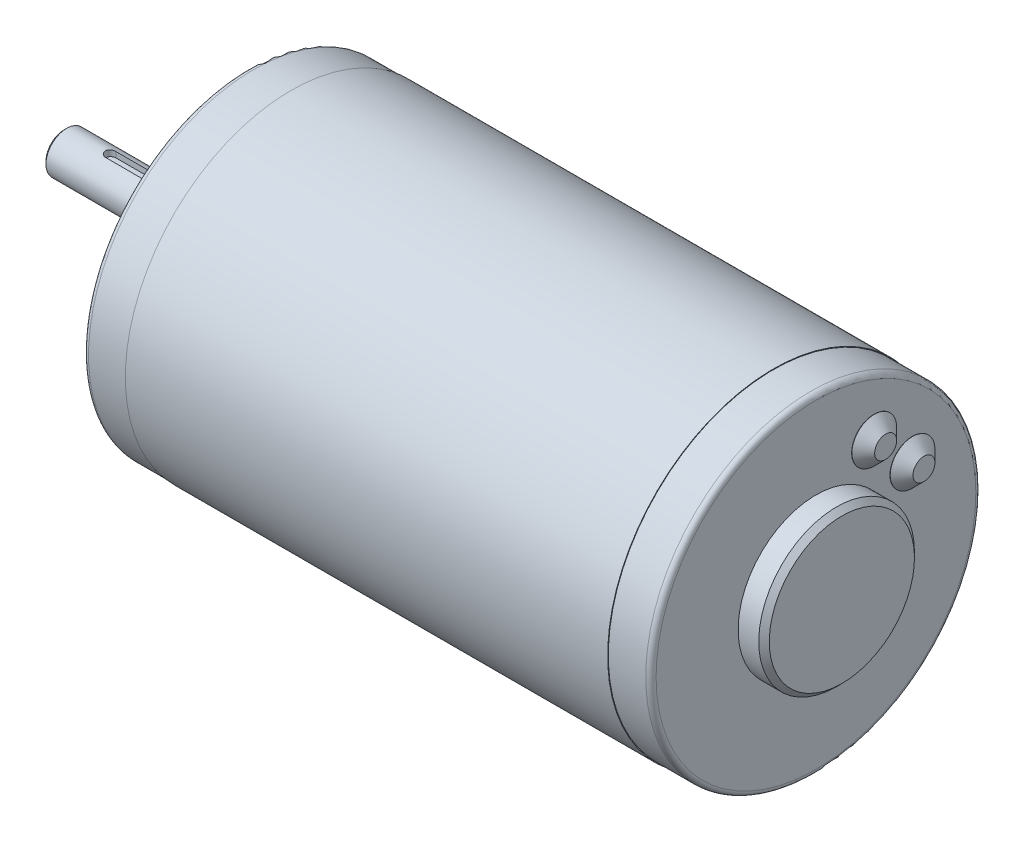
ISO-10303-21;
HEADER;
FILE_DESCRIPTION(('STEP AP214'),'2;1');
FILE_NAME('part.step','',(''),(''),'','','');
FILE_SCHEMA(('AUTOMOTIVE_DESIGN { 1 0 10303 214 1 1 1 1 }'));
ENDSEC;
DATA;
#1=APPLICATION_CONTEXT('core data for automotive mechanical design processes');
#2=APPLICATION_PROTOCOL_DEFINITION('international standard','automotive_design',2000,#1);
#3=PRODUCT_CONTEXT('',#1,'mechanical');
#4=PRODUCT('Part','Part','',(#3));
#5=PRODUCT_RELATED_PRODUCT_CATEGORY('part','',(#4));
#6=PRODUCT_DEFINITION_FORMATION('','',#4);
#7=PRODUCT_DEFINITION_CONTEXT('part definition',#1,'design');
#8=PRODUCT_DEFINITION('design','',#6,#7);
#9=PRODUCT_DEFINITION_SHAPE('','',#8);
#10=(LENGTH_UNIT() NAMED_UNIT(*) SI_UNIT(.MILLI.,.METRE.));
#11=(NAMED_UNIT(*) PLANE_ANGLE_UNIT() SI_UNIT($,.RADIAN.));
#12=(NAMED_UNIT(*) SI_UNIT($,.STERADIAN.) SOLID_ANGLE_UNIT());
#13=UNCERTAINTY_MEASURE_WITH_UNIT(LENGTH_MEASURE(1.E-05),#10,'distance_accuracy_value','');
#14=(GEOMETRIC_REPRESENTATION_CONTEXT(3) GLOBAL_UNCERTAINTY_ASSIGNED_CONTEXT((#13)) GLOBAL_UNIT_ASSIGNED_CONTEXT((#10,
#11,#12)) REPRESENTATION_CONTEXT('',''));
#15=CARTESIAN_POINT('',(0.,0.,0.));
#16=DIRECTION('',(0.,0.,1.));
#17=DIRECTION('',(1.,0.,0.));
#18=AXIS2_PLACEMENT_3D('',#15,#16,#17);
#19=CARTESIAN_POINT('',(-27.6,2.79999999999999,-1.));
#20=DIRECTION('',(0.,-1.,0.));
#21=DIRECTION('',(0.,0.,-1.));
#22=AXIS2_PLACEMENT_3D('',#19,#20,#21);
#23=PLANE('',#22);
#24=CARTESIAN_POINT('',(-7.1,2.79999999999999,0.));
#25=DIRECTION('',(0.,1.,0.));
#26=DIRECTION('',(0.,0.,1.));
#27=AXIS2_PLACEMENT_3D('',#24,#25,#26);
#28=CIRCLE('',#27,1.);
#29=CARTESIAN_POINT('',(-7.1,2.79999999999999,1.));
#30=VERTEX_POINT('',#29);
#31=CARTESIAN_POINT('',(-7.1,2.79999999999999,-1.));
#32=VERTEX_POINT('',#31);
#33=EDGE_CURVE('E80',#30,#32,#28,.T.);
#34=ORIENTED_EDGE('',*,*,#33,.T.);
#35=DIRECTION('',(1.,0.,0.));
#36=VECTOR('',#35,1.);
#37=CARTESIAN_POINT('',(-27.6,2.79999999999999,-1.));
#38=LINE('',#37,#36);
#39=CARTESIAN_POINT('',(-26.6,2.79999999999999,-1.));
#40=VERTEX_POINT('',#39);
#41=EDGE_CURVE('E75',#40,#32,#38,.T.);
#42=ORIENTED_EDGE('',*,*,#41,.F.);
#43=CARTESIAN_POINT('',(-26.6,2.79999999999999,0.));
#44=DIRECTION('',(0.,-1.,0.));
#45=DIRECTION('',(0.,0.,-1.));
#46=AXIS2_PLACEMENT_3D('',#43,#44,#45);
#47=CIRCLE('',#46,1.);
#48=CARTESIAN_POINT('',(-26.6,2.79999999999999,1.));
#49=VERTEX_POINT('',#48);
#50=EDGE_CURVE('E77',#40,#49,#47,.F.);
#51=ORIENTED_EDGE('',*,*,#50,.T.);
#52=DIRECTION('',(1.,0.,0.));
#53=VECTOR('',#52,1.);
#54=CARTESIAN_POINT('',(-27.6,2.79999999999999,1.));
#55=LINE('',#54,#53);
#56=EDGE_CURVE('E103',#49,#30,#55,.T.);
#57=ORIENTED_EDGE('',*,*,#56,.T.);
#58=EDGE_LOOP('',(#34,#42,#51,#57));
#59=FACE_BOUND('',#58,.T.);
#60=ADVANCED_FACE('F17',(#59),#23,.F.);
#61=CARTESIAN_POINT('',(-35.6,0.,0.));
#62=DIRECTION('',(-1.,0.,0.));
#63=DIRECTION('',(0.,0.,1.));
#64=AXIS2_PLACEMENT_3D('',#61,#62,#63);
#65=PLANE('',#64);
#66=CARTESIAN_POINT('',(-35.6000000000449,0.,0.));
#67=DIRECTION('',(1.,0.,0.));
#68=DIRECTION('',(0.,0.,-1.));
#69=AXIS2_PLACEMENT_3D('',#66,#67,#68);
#70=CIRCLE('',#69,3.49999999997408);
#71=CARTESIAN_POINT('',(-35.6000000000449,0.,-3.49999999997408));
#72=VERTEX_POINT('',#71);
#73=EDGE_CURVE('E327',#72,#72,#70,.T.);
#74=ORIENTED_EDGE('',*,*,#73,.F.);
#75=EDGE_LOOP('',(#74));
#76=FACE_BOUND('',#75,.T.);
#77=ADVANCED_FACE('F611',(#76),#65,.T.);
#78=CARTESIAN_POINT('',(-26.6,3.87298334620741,0.));
#79=DIRECTION('',(0.,-1.,0.));
#80=DIRECTION('',(0.,0.,-1.));
#81=AXIS2_PLACEMENT_3D('',#78,#79,#80);
#82=CYLINDRICAL_SURFACE('',#81,1.);
#83=CARTESIAN_POINT('',(-26.6,3.87298334620741,1.));
#84=CARTESIAN_POINT('',(-26.6276629851065,3.87298148580177,1.00000033749611));
#85=CARTESIAN_POINT('',(-26.6553122630182,3.8732800994947,0.998851407375366));
#86=CARTESIAN_POINT('',(-26.7104040353036,3.87445904774558,0.994271295395754));
#87=CARTESIAN_POINT('',(-26.7378465636871,3.87533928441687,0.99084049757268));
#88=CARTESIAN_POINT('',(-26.8194531732088,3.87881710972053,0.977175239382527));
#89=CARTESIAN_POINT('',(-26.8730564684822,3.88225203148808,0.963567695172493));
#90=CARTESIAN_POINT('',(-26.977124673782,3.89095422588002,0.927798076247996));
#91=CARTESIAN_POINT('',(-27.0275898782129,3.89622132630929,0.905636805423835));
#92=CARTESIAN_POINT('',(-27.1241114486473,3.90799134471939,0.853415378025865));
#93=CARTESIAN_POINT('',(-27.170166627891,3.91449459395647,0.823353103356933));
#94=CARTESIAN_POINT('',(-27.2575438819061,3.92816262398025,0.755484471828068));
#95=CARTESIAN_POINT('',(-27.2987548862455,3.93533791028915,0.717537268783974));
#96=CARTESIAN_POINT('',(-27.3743020894827,3.94945104396193,0.635275780516228));
#97=CARTESIAN_POINT('',(-27.4086371894679,3.95638885322537,0.590960479478829));
#98=CARTESIAN_POINT('',(-27.4699110016186,3.96936182283248,0.496456899401689));
#99=CARTESIAN_POINT('',(-27.496739895984,3.9753830468173,0.446195340334472));
#100=CARTESIAN_POINT('',(-27.5415247341967,3.98572346250588,0.341702590842916));
#101=CARTESIAN_POINT('',(-27.5594824242998,3.990042989147,0.287472184083007));
#102=CARTESIAN_POINT('',(-27.5856589927774,3.99641900005128,0.177744108525158));
#103=CARTESIAN_POINT('',(-27.5940676724228,3.998519529013,0.122294322002856));
#104=CARTESIAN_POINT('',(-27.6015033715433,4.00037438150815,0.0107327756816783));
#105=CARTESIAN_POINT('',(-27.6005315701923,4.00012899993444,-0.0453789000287066));
#106=CARTESIAN_POINT('',(-27.5893700363145,3.99735237365735,-0.155352492972097));
#107=CARTESIAN_POINT('',(-27.5793853834005,3.9948719867736,-0.209236701739855));
#108=CARTESIAN_POINT('',(-27.5508113208172,3.98796330636495,-0.31453871108434));
#109=CARTESIAN_POINT('',(-27.5322215304314,3.98353492665556,-0.365956402423988));
#110=CARTESIAN_POINT('',(-27.4867987193293,3.97314997761798,-0.46540728602454));
#111=CARTESIAN_POINT('',(-27.4598926057672,3.96717993827555,-0.513405629602248));
#112=CARTESIAN_POINT('',(-27.3986568701665,3.95435945541919,-0.604276631230015));
#113=CARTESIAN_POINT('',(-27.3643261297468,3.94750887933198,-0.64714851556229));
#114=CARTESIAN_POINT('',(-27.2881210879187,3.93345566022865,-0.727769389708492));
#115=CARTESIAN_POINT('',(-27.2460683634602,3.92624850477685,-0.765349103054128));
#116=CARTESIAN_POINT('',(-27.1561701330723,3.91246168284006,-0.832969575186237));
#117=CARTESIAN_POINT('',(-27.1083230467164,3.90588218842993,-0.863008270245062));
#118=CARTESIAN_POINT('',(-27.0078544021762,3.89407813586325,-0.914804709285962));
#119=CARTESIAN_POINT('',(-26.9552085351039,3.88886106009136,-0.936517017887269));
#120=CARTESIAN_POINT('',(-26.8468830715817,3.88047058807055,-0.970702351849828));
#121=CARTESIAN_POINT('',(-26.7912081448502,3.87729413761435,-0.983189189212132));
#122=CARTESIAN_POINT('',(-26.7125426192411,3.87455290681524,-0.993904635150938));
#123=CARTESIAN_POINT('',(-26.6900802967868,3.87396523110859,-0.996190790966708));
#124=CARTESIAN_POINT('',(-26.6450822100907,3.87318062488974,-0.999236757697394));
#125=CARTESIAN_POINT('',(-26.6225466240447,3.87298306219461,-0.999999038096045));
#126=CARTESIAN_POINT('',(-26.6,3.87298334620741,-1.));
#127=B_SPLINE_CURVE_WITH_KNOTS('',3,(#83,#84,#85,#86,#87,#88,#89,#90,#91,#92,#93,#94,#95,#96,
#97,#98,#99,#100,#101,#102,#103,#104,#105,#106,#107,#108,#109,#110,#111,#112,#113,#114,#115,
#116,#117,#118,#119,#120,#121,#122,#123,#124,#125,#126),.UNSPECIFIED.,.F.,.F.,(4,2,2,2,2,2,2,2,
2,2,2,2,2,2,2,2,2,2,2,2,2,4),(0.,0.0829365303397693,0.16585910608465,0.331229963080318,
0.496585282091499,0.661984974726751,0.830641897427977,0.999325753539196,1.17036187098235,
1.34136430732425,1.50890481515325,1.67642426256639,1.84022545479276,2.00403389475838,
2.16932509450376,2.33464120964329,2.50441429534542,2.67423379180967,2.84496720161068,
3.01544447539986,3.08315848722648,3.15076267731671),.UNSPECIFIED.);
#128=CARTESIAN_POINT('',(-26.6,3.87298334620741,1.));
#129=VERTEX_POINT('',#128);
#130=CARTESIAN_POINT('',(-26.6,3.87298334620741,-1.));
#131=VERTEX_POINT('',#130);
#132=EDGE_CURVE('E162',#129,#131,#127,.T.);
#133=ORIENTED_EDGE('',*,*,#132,.F.);
#134=DIRECTION('',(0.,1.,0.));
#135=VECTOR('',#134,1.);
#136=CARTESIAN_POINT('',(-26.6,2.79999999999999,1.));
#137=LINE('',#136,#135);
#138=EDGE_CURVE('E90',#129,#49,#137,.F.);
#139=ORIENTED_EDGE('',*,*,#138,.T.);
#140=ORIENTED_EDGE('',*,*,#50,.F.);
#141=DIRECTION('',(0.,1.,0.));
#142=VECTOR('',#141,1.);
#143=CARTESIAN_POINT('',(-26.6,2.79999999999999,-1.));
#144=LINE('',#143,#142);
#145=EDGE_CURVE('E84',#131,#40,#144,.F.);
#146=ORIENTED_EDGE('',*,*,#145,.F.);
#147=EDGE_LOOP('',(#133,#139,#140,#146));
#148=FACE_BOUND('',#147,.T.);
#149=ADVANCED_FACE('F87',(#148),#82,.F.);
#150=CARTESIAN_POINT('',(-27.6,2.79999999999999,-1.));
#151=DIRECTION('',(0.,0.,1.));
#152=DIRECTION('',(1.,0.,0.));
#153=AXIS2_PLACEMENT_3D('',#150,#151,#152);
#154=PLANE('',#153);
#155=DIRECTION('',(1.,0.,0.));
#156=VECTOR('',#155,1.);
#157=CARTESIAN_POINT('',(0.,3.87298334620741,-1.));
#158=LINE('',#157,#156);
#159=CARTESIAN_POINT('',(-7.1,3.87298334620741,-1.));
#160=VERTEX_POINT('',#159);
#161=EDGE_CURVE('E95',#131,#160,#158,.T.);
#162=ORIENTED_EDGE('',*,*,#161,.F.);
#163=ORIENTED_EDGE('',*,*,#145,.T.);
#164=ORIENTED_EDGE('',*,*,#41,.T.);
#165=DIRECTION('',(0.,1.,0.));
#166=VECTOR('',#165,1.);
#167=CARTESIAN_POINT('',(-7.1,2.79999999999999,-1.));
#168=LINE('',#167,#166);
#169=EDGE_CURVE('E98',#32,#160,#168,.T.);
#170=ORIENTED_EDGE('',*,*,#169,.T.);
#171=EDGE_LOOP('',(#162,#163,#164,#170));
#172=FACE_BOUND('',#171,.T.);
#173=ADVANCED_FACE('F93',(#172),#154,.T.);
#174=CARTESIAN_POINT('',(-7.1,2.79999999999999,0.));
#175=DIRECTION('',(0.,1.,0.));
#176=DIRECTION('',(0.,0.,1.));
#177=AXIS2_PLACEMENT_3D('',#174,#175,#176);
#178=CYLINDRICAL_SURFACE('',#177,1.);
#179=ORIENTED_EDGE('',*,*,#33,.F.);
#180=DIRECTION('',(0.,1.,0.));
#181=VECTOR('',#180,1.);
#182=CARTESIAN_POINT('',(-7.1,2.79999999999999,1.));
#183=LINE('',#182,#181);
#184=CARTESIAN_POINT('',(-7.1,3.87298334620741,1.));
#185=VERTEX_POINT('',#184);
#186=EDGE_CURVE('E104',#30,#185,#183,.T.);
#187=ORIENTED_EDGE('',*,*,#186,.T.);
#188=CARTESIAN_POINT('',(-7.1,3.87298334620741,-1.));
#189=CARTESIAN_POINT('',(-7.07233701489346,3.87298148580177,-1.00000033749611));
#190=CARTESIAN_POINT('',(-7.04468773698177,3.8732800994947,-0.998851407375366));
#191=CARTESIAN_POINT('',(-6.98959596469644,3.87445904774558,-0.994271295395754));
#192=CARTESIAN_POINT('',(-6.96215343631291,3.87533928441687,-0.990840497572679));
#193=CARTESIAN_POINT('',(-6.88054682679116,3.87881710972053,-0.977175239382527));
#194=CARTESIAN_POINT('',(-6.82694353151779,3.88225203148808,-0.963567695172494));
#195=CARTESIAN_POINT('',(-6.72287532621804,3.89095422588002,-0.927798076247997));
#196=CARTESIAN_POINT('',(-6.67241012178715,3.89622132630929,-0.905636805423836));
#197=CARTESIAN_POINT('',(-6.57588855135267,3.90799134471939,-0.853415378025865));
#198=CARTESIAN_POINT('',(-6.52983337210904,3.91449459395647,-0.823353103356933));
#199=CARTESIAN_POINT('',(-6.4424561180939,3.92816262398025,-0.755484471828069));
#200=CARTESIAN_POINT('',(-6.40124511375448,3.93533791028915,-0.717537268783976));
#201=CARTESIAN_POINT('',(-6.3256979105173,3.94945104396193,-0.63527578051623));
#202=CARTESIAN_POINT('',(-6.29136281053206,3.95638885322537,-0.590960479478831));
#203=CARTESIAN_POINT('',(-6.23008899838136,3.96936182283248,-0.496456899401691));
#204=CARTESIAN_POINT('',(-6.20326010401603,3.9753830468173,-0.446195340334474));
#205=CARTESIAN_POINT('',(-6.1584752658033,3.98572346250588,-0.341702590842919));
#206=CARTESIAN_POINT('',(-6.14051757570017,3.990042989147,-0.28747218408301));
#207=CARTESIAN_POINT('',(-6.11434100722257,3.99641900005128,-0.17774410852516));
#208=CARTESIAN_POINT('',(-6.10593232757718,3.998519529013,-0.122294322002858));
#209=CARTESIAN_POINT('',(-6.09849662845671,4.00037438150815,-0.0107327756816796));
#210=CARTESIAN_POINT('',(-6.09946842980766,4.00012899993444,0.0453789000287056));
#211=CARTESIAN_POINT('',(-6.11062996368545,3.99735237365735,0.155352492972096));
#212=CARTESIAN_POINT('',(-6.12061461659948,3.9948719867736,0.209236701739855));
#213=CARTESIAN_POINT('',(-6.14918867918275,3.98796330636495,0.31453871108434));
#214=CARTESIAN_POINT('',(-6.16777846956858,3.98353492665556,0.365956402423988));
#215=CARTESIAN_POINT('',(-6.21320128067065,3.97314997761798,0.465407286024539));
#216=CARTESIAN_POINT('',(-6.24010739423284,3.96717993827555,0.513405629602249));
#217=CARTESIAN_POINT('',(-6.30134312983347,3.95435945541919,0.604276631230014));
#218=CARTESIAN_POINT('',(-6.33567387025322,3.94750887933198,0.647148515562289));
#219=CARTESIAN_POINT('',(-6.41187891208131,3.93345566022865,0.72776938970849));
#220=CARTESIAN_POINT('',(-6.45393163653982,3.92624850477685,0.765349103054127));
#221=CARTESIAN_POINT('',(-6.54382986692774,3.91246168284006,0.832969575186237));
#222=CARTESIAN_POINT('',(-6.59167695328356,3.90588218842993,0.863008270245062));
#223=CARTESIAN_POINT('',(-6.69214559782377,3.89407813586325,0.914804709285962));
#224=CARTESIAN_POINT('',(-6.74479146489609,3.88886106009136,0.936517017887269));
#225=CARTESIAN_POINT('',(-6.85311692841829,3.88047058807055,0.970702351849828));
#226=CARTESIAN_POINT('',(-6.90879185514984,3.87729413761435,0.983189189212131));
#227=CARTESIAN_POINT('',(-6.98745738075891,3.87455290681524,0.993904635150938));
#228=CARTESIAN_POINT('',(-7.00991970321318,3.87396523110859,0.996190790966708));
#229=CARTESIAN_POINT('',(-7.05491778990932,3.87318062488974,0.999236757697394));
#230=CARTESIAN_POINT('',(-7.07745337595529,3.8729830621946,0.999999038096045));
#231=CARTESIAN_POINT('',(-7.1,3.87298334620741,1.));
#232=B_SPLINE_CURVE_WITH_KNOTS('',3,(#188,#189,#190,#191,#192,#193,#194,#195,#196,#197,#198,
#199,#200,#201,#202,#203,#204,#205,#206,#207,#208,#209,#210,#211,#212,#213,#214,#215,#216,#217,
#218,#219,#220,#221,#222,#223,#224,#225,#226,#227,#228,#229,#230,#231),.UNSPECIFIED.,.F.,.F.,(4,
2,2,2,2,2,2,2,2,2,2,2,2,2,2,2,2,2,2,2,2,4),(0.,0.0829365303397684,0.165859106084651,
0.331229963080317,0.496585282091498,0.661984974726749,0.830641897427974,0.999325753539193,
1.17036187098235,1.34136430732424,1.50890481515325,1.67642426256639,1.84022545479276,
2.00403389475838,2.16932509450376,2.33464120964329,2.50441429534542,2.67423379180967,
2.84496720161068,3.01544447539986,3.08315848722648,3.15076267731671),.UNSPECIFIED.);
#233=EDGE_CURVE('E152',#160,#185,#232,.T.);
#234=ORIENTED_EDGE('',*,*,#233,.F.);
#235=ORIENTED_EDGE('',*,*,#169,.F.);
#236=EDGE_LOOP('',(#179,#187,#234,#235));
#237=FACE_BOUND('',#236,.T.);
#238=ADVANCED_FACE('F169',(#237),#178,.F.);
#239=CARTESIAN_POINT('',(-27.6,2.79999999999999,1.));
#240=DIRECTION('',(0.,0.,1.));
#241=DIRECTION('',(1.,0.,0.));
#242=AXIS2_PLACEMENT_3D('',#239,#240,#241);
#243=PLANE('',#242);
#244=ORIENTED_EDGE('',*,*,#186,.F.);
#245=ORIENTED_EDGE('',*,*,#56,.F.);
#246=ORIENTED_EDGE('',*,*,#138,.F.);
#247=DIRECTION('',(1.,0.,0.));
#248=VECTOR('',#247,1.);
#249=CARTESIAN_POINT('',(0.,3.87298334620741,1.));
#250=LINE('',#249,#248);
#251=EDGE_CURVE('E161',#185,#129,#250,.F.);
#252=ORIENTED_EDGE('',*,*,#251,.F.);
#253=EDGE_LOOP('',(#244,#245,#246,#252));
#254=FACE_BOUND('',#253,.T.);
#255=ADVANCED_FACE('F184',(#254),#243,.F.);
#256=CARTESIAN_POINT('',(-35.0999999999999,0.,0.));
#257=DIRECTION('',(1.,0.,0.));
#258=DIRECTION('',(0.,0.,-1.));
#259=AXIS2_PLACEMENT_3D('',#256,#257,#258);
#260=CONICAL_SURFACE('',#259,3.99999999996226,0.785398163340605);
#261=ORIENTED_EDGE('',*,*,#73,.T.);
#262=EDGE_LOOP('',(#261));
#263=FACE_BOUND('',#262,.T.);
#264=CARTESIAN_POINT('',(-35.1,0.,0.));
#265=DIRECTION('',(1.,0.,0.));
#266=DIRECTION('',(0.,0.,-1.));
#267=AXIS2_PLACEMENT_3D('',#264,#265,#266);
#268=CIRCLE('',#267,4.);
#269=CARTESIAN_POINT('',(-35.1,0.,-4.));
#270=VERTEX_POINT('',#269);
#271=EDGE_CURVE('E151',#270,#270,#268,.T.);
#272=ORIENTED_EDGE('',*,*,#271,.F.);
#273=EDGE_LOOP('',(#272));
#274=FACE_BOUND('',#273,.T.);
#275=ADVANCED_FACE('F179',(#263,#274),#260,.T.);
#276=CARTESIAN_POINT('',(0.,0.,0.));
#277=DIRECTION('',(1.,0.,0.));
#278=DIRECTION('',(0.,0.,-1.));
#279=AXIS2_PLACEMENT_3D('',#276,#277,#278);
#280=CYLINDRICAL_SURFACE('',#279,4.);
#281=ORIENTED_EDGE('',*,*,#271,.T.);
#282=EDGE_LOOP('',(#281));
#283=FACE_BOUND('',#282,.T.);
#284=CARTESIAN_POINT('',(-4.,0.,0.));
#285=DIRECTION('',(1.,0.,0.));
#286=DIRECTION('',(0.,0.,-1.));
#287=AXIS2_PLACEMENT_3D('',#284,#285,#286);
#288=CIRCLE('',#287,4.);
#289=CARTESIAN_POINT('',(-4.,0.,-4.));
#290=VERTEX_POINT('',#289);
#291=EDGE_CURVE('E148',#290,#290,#288,.T.);
#292=ORIENTED_EDGE('',*,*,#291,.F.);
#293=EDGE_LOOP('',(#292));
#294=FACE_BOUND('',#293,.T.);
#295=ORIENTED_EDGE('',*,*,#233,.T.);
#296=ORIENTED_EDGE('',*,*,#251,.T.);
#297=ORIENTED_EDGE('',*,*,#132,.T.);
#298=ORIENTED_EDGE('',*,*,#161,.T.);
#299=EDGE_LOOP('',(#295,#296,#297,#298));
#300=FACE_BOUND('',#299,.T.);
#301=ADVANCED_FACE('F173',(#283,#294,#300),#280,.T.);
#302=CARTESIAN_POINT('',(-4.,4.,0.));
#303=DIRECTION('',(-1.,0.,0.));
#304=DIRECTION('',(0.,0.,1.));
#305=AXIS2_PLACEMENT_3D('',#302,#303,#304);
#306=PLANE('',#305);
#307=ORIENTED_EDGE('',*,*,#291,.T.);
#308=EDGE_LOOP('',(#307));
#309=FACE_BOUND('',#308,.T.);
#310=CARTESIAN_POINT('',(-4.,0.,0.));
#311=DIRECTION('',(1.,0.,0.));
#312=DIRECTION('',(0.,1.,0.));
#313=AXIS2_PLACEMENT_3D('',#310,#311,#312);
#314=CIRCLE('',#313,8.509);
#315=CARTESIAN_POINT('',(-4.,8.509,0.));
#316=VERTEX_POINT('',#315);
#317=EDGE_CURVE('E145',#316,#316,#314,.T.);
#318=ORIENTED_EDGE('',*,*,#317,.F.);
#319=EDGE_LOOP('',(#318));
#320=FACE_BOUND('',#319,.T.);
#321=ADVANCED_FACE('F178',(#309,#320),#306,.T.);
#322=CARTESIAN_POINT('',(111.8479,18.6070906828553,-11.2073596390943));
#323=DIRECTION('',(1.,0.,0.));
#324=DIRECTION('',(0.,0.,-1.));
#325=AXIS2_PLACEMENT_3D('',#322,#323,#324);
#326=PLANE('',#325);
#327=CARTESIAN_POINT('',(111.84789999993,18.6070906828553,-11.2073596390943));
#328=DIRECTION('',(-1.,0.,0.));
#329=DIRECTION('',(0.,-1.,0.));
#330=AXIS2_PLACEMENT_3D('',#327,#328,#329);
#331=CIRCLE('',#330,2.11800000003146);
#332=CARTESIAN_POINT('',(111.84789999993,16.4890906828238,-11.2073596390943));
#333=VERTEX_POINT('',#332);
#334=EDGE_CURVE('E142',#333,#333,#331,.T.);
#335=ORIENTED_EDGE('',*,*,#334,.F.);
#336=EDGE_LOOP('',(#335));
#337=FACE_BOUND('',#336,.T.);
#338=ADVANCED_FACE('F392',(#337),#326,.T.);
#339=CARTESIAN_POINT('',(114.6,15.0368,0.));
#340=DIRECTION('',(1.,0.,0.));
#341=DIRECTION('',(0.,0.,-1.));
#342=AXIS2_PLACEMENT_3D('',#339,#340,#341);
#343=PLANE('',#342);
#344=CARTESIAN_POINT('',(114.6,0.,0.));
#345=DIRECTION('',(-1.,0.,0.));
#346=DIRECTION('',(0.,-1.,0.));
#347=AXIS2_PLACEMENT_3D('',#344,#345,#346);
#348=CIRCLE('',#347,14.0208);
#349=CARTESIAN_POINT('',(114.6,-14.0208,0.));
#350=VERTEX_POINT('',#349);
#351=EDGE_CURVE('E139',#350,#350,#348,.T.);
#352=ORIENTED_EDGE('',*,*,#351,.F.);
#353=EDGE_LOOP('',(#352));
#354=FACE_BOUND('',#353,.T.);
#355=ADVANCED_FACE('F398',(#354),#343,.T.);
#356=CARTESIAN_POINT('',(111.8479,11.2073596390943,-18.6070906828553));
#357=DIRECTION('',(1.,0.,0.));
#358=DIRECTION('',(0.,0.,-1.));
#359=AXIS2_PLACEMENT_3D('',#356,#357,#358);
#360=PLANE('',#359);
#361=CARTESIAN_POINT('',(111.84789999993,11.2073596390943,-18.6070906828553));
#362=DIRECTION('',(-1.,0.,0.));
#363=DIRECTION('',(0.,0.,1.));
#364=AXIS2_PLACEMENT_3D('',#361,#362,#363);
#365=CIRCLE('',#364,2.1180000000021);
#366=CARTESIAN_POINT('',(111.84789999993,11.2073596390943,-16.4890906828532));
#367=VERTEX_POINT('',#366);
#368=EDGE_CURVE('E135',#367,#367,#365,.T.);
#369=ORIENTED_EDGE('',*,*,#368,.F.);
#370=EDGE_LOOP('',(#369));
#371=FACE_BOUND('',#370,.T.);
#372=ADVANCED_FACE('F407',(#371),#360,.T.);
#373=CARTESIAN_POINT('',(13.6143999999945,25.4,0.));
#374=DIRECTION('',(-1.,0.,0.));
#375=DIRECTION('',(0.,0.,1.));
#376=AXIS2_PLACEMENT_3D('',#373,#374,#375);
#377=CONICAL_SURFACE('',#376,2.01929999997219,1.02974425867198);
#378=CARTESIAN_POINT('',(14.827717847993,25.4,0.));
#379=VERTEX_POINT('',#378);
#380=VERTEX_LOOP('',#379);
#381=FACE_BOUND('',#380,.T.);
#382=CARTESIAN_POINT('',(13.6144,25.4,0.));
#383=DIRECTION('',(-1.,0.,0.));
#384=DIRECTION('',(0.,0.,1.));
#385=AXIS2_PLACEMENT_3D('',#382,#383,#384);
#386=CIRCLE('',#385,2.0193);
#387=CARTESIAN_POINT('',(13.6144,25.4,2.0193));
#388=VERTEX_POINT('',#387);
#389=EDGE_CURVE('E138',#388,#388,#386,.T.);
#390=ORIENTED_EDGE('',*,*,#389,.T.);
#391=EDGE_LOOP('',(#390));
#392=FACE_BOUND('',#391,.T.);
#393=ADVANCED_FACE('F413',(#381,#392),#377,.F.);
#394=CARTESIAN_POINT('',(13.6143999999945,-25.4,0.));
#395=DIRECTION('',(-1.,0.,0.));
#396=DIRECTION('',(0.,0.,1.));
#397=AXIS2_PLACEMENT_3D('',#394,#395,#396);
#398=CONICAL_SURFACE('',#397,2.01929999997219,1.02974425867198);
#399=CARTESIAN_POINT('',(14.827717847993,-25.4,0.));
#400=VERTEX_POINT('',#399);
#401=VERTEX_LOOP('',#400);
#402=FACE_BOUND('',#401,.T.);
#403=CARTESIAN_POINT('',(13.6144,-25.4,0.));
#404=DIRECTION('',(-1.,0.,0.));
#405=DIRECTION('',(0.,0.,1.));
#406=AXIS2_PLACEMENT_3D('',#403,#404,#405);
#407=CIRCLE('',#406,2.0193);
#408=CARTESIAN_POINT('',(13.6144,-25.4,2.0193));
#409=VERTEX_POINT('',#408);
#410=EDGE_CURVE('E317',#409,#409,#407,.T.);
#411=ORIENTED_EDGE('',*,*,#410,.T.);
#412=EDGE_LOOP('',(#411));
#413=FACE_BOUND('',#412,.T.);
#414=ADVANCED_FACE('F544',(#402,#413),#398,.F.);
#415=CARTESIAN_POINT('',(-2.984,0.,0.));
#416=DIRECTION('',(1.,0.,0.));
#417=DIRECTION('',(0.,1.,0.));
#418=AXIS2_PLACEMENT_3D('',#415,#416,#417);
#419=CONICAL_SURFACE('',#418,9.525,0.78539816339745);
#420=ORIENTED_EDGE('',*,*,#317,.T.);
#421=EDGE_LOOP('',(#420));
#422=FACE_BOUND('',#421,.T.);
#423=CARTESIAN_POINT('',(-2.984,0.,0.));
#424=DIRECTION('',(1.,0.,0.));
#425=DIRECTION('',(0.,0.,-1.));
#426=AXIS2_PLACEMENT_3D('',#423,#424,#425);
#427=CIRCLE('',#426,9.525);
#428=CARTESIAN_POINT('',(-2.984,0.,-9.525));
#429=VERTEX_POINT('',#428);
#430=EDGE_CURVE('E314',#429,#429,#427,.T.);
#431=ORIENTED_EDGE('',*,*,#430,.F.);
#432=EDGE_LOOP('',(#431));
#433=FACE_BOUND('',#432,.T.);
#434=ADVANCED_FACE('F428',(#422,#433),#419,.T.);
#435=CARTESIAN_POINT('',(109.647900000027,18.6070906828553,-11.2073596390943));
#436=DIRECTION('',(-1.,0.,0.));
#437=DIRECTION('',(0.,-1.,0.));
#438=AXIS2_PLACEMENT_3D('',#435,#436,#437);
#439=CONICAL_SURFACE('',#438,4.31799999987712,0.785398163384529);
#440=CARTESIAN_POINT('',(109.6479,18.6070906828553,-11.2073596390943));
#441=DIRECTION('',(-1.,0.,0.));
#442=DIRECTION('',(0.,0.,1.));
#443=AXIS2_PLACEMENT_3D('',#440,#441,#442);
#444=CIRCLE('',#443,4.318);
#445=CARTESIAN_POINT('',(109.6479,18.6070906828553,-6.88935963909434));
#446=VERTEX_POINT('',#445);
#447=EDGE_CURVE('E311',#446,#446,#444,.T.);
#448=ORIENTED_EDGE('',*,*,#447,.F.);
#449=EDGE_LOOP('',(#448));
#450=FACE_BOUND('',#449,.T.);
#451=ORIENTED_EDGE('',*,*,#334,.T.);
#452=EDGE_LOOP('',(#451));
#453=FACE_BOUND('',#452,.T.);
#454=ADVANCED_FACE('F421',(#450,#453),#439,.T.);
#455=CARTESIAN_POINT('',(113.584,0.,0.));
#456=DIRECTION('',(-1.,0.,0.));
#457=DIRECTION('',(0.,-1.,0.));
#458=AXIS2_PLACEMENT_3D('',#455,#456,#457);
#459=CONICAL_SURFACE('',#458,15.0368,0.785398163397441);
#460=ORIENTED_EDGE('',*,*,#351,.T.);
#461=EDGE_LOOP('',(#460));
#462=FACE_BOUND('',#461,.T.);
#463=CARTESIAN_POINT('',(113.584,0.,0.));
#464=DIRECTION('',(1.,0.,0.));
#465=DIRECTION('',(0.,0.,-1.));
#466=AXIS2_PLACEMENT_3D('',#463,#464,#465);
#467=CIRCLE('',#466,15.0368);
#468=CARTESIAN_POINT('',(113.584,0.,-15.0368));
#469=VERTEX_POINT('',#468);
#470=EDGE_CURVE('E308',#469,#469,#467,.F.);
#471=ORIENTED_EDGE('',*,*,#470,.F.);
#472=EDGE_LOOP('',(#471));
#473=FACE_BOUND('',#472,.T.);
#474=ADVANCED_FACE('F427',(#462,#473),#459,.T.);
#475=CARTESIAN_POINT('',(109.647900000084,11.2073596390943,-18.6070906828553));
#476=DIRECTION('',(-1.,0.,0.));
#477=DIRECTION('',(0.,0.,1.));
#478=AXIS2_PLACEMENT_3D('',#475,#476,#477);
#479=CONICAL_SURFACE('',#478,4.31799999990461,0.785398163410367);
#480=CARTESIAN_POINT('',(109.6479,11.2073596390943,-18.6070906828553));
#481=DIRECTION('',(-1.,0.,0.));
#482=DIRECTION('',(0.,0.,1.));
#483=AXIS2_PLACEMENT_3D('',#480,#481,#482);
#484=CIRCLE('',#483,4.318);
#485=CARTESIAN_POINT('',(109.6479,11.2073596390943,-14.2890906828553));
#486=VERTEX_POINT('',#485);
#487=EDGE_CURVE('E134',#486,#486,#484,.T.);
#488=ORIENTED_EDGE('',*,*,#487,.F.);
#489=EDGE_LOOP('',(#488));
#490=FACE_BOUND('',#489,.T.);
#491=ORIENTED_EDGE('',*,*,#368,.T.);
#492=EDGE_LOOP('',(#491));
#493=FACE_BOUND('',#492,.T.);
#494=ADVANCED_FACE('F438',(#490,#493),#479,.T.);
#495=CARTESIAN_POINT('',(0.,25.4,0.));
#496=DIRECTION('',(-1.,0.,0.));
#497=DIRECTION('',(0.,0.,1.));
#498=AXIS2_PLACEMENT_3D('',#495,#496,#497);
#499=CYLINDRICAL_SURFACE('',#498,2.0193);
#500=CARTESIAN_POINT('',(0.,25.4,0.));
#501=DIRECTION('',(-1.,0.,0.));
#502=DIRECTION('',(0.,0.,1.));
#503=AXIS2_PLACEMENT_3D('',#500,#501,#502);
#504=CIRCLE('',#503,2.0193);
#505=CARTESIAN_POINT('',(0.,25.4,2.0193));
#506=VERTEX_POINT('',#505);
#507=EDGE_CURVE('E131',#506,#506,#504,.F.);
#508=ORIENTED_EDGE('',*,*,#507,.F.);
#509=EDGE_LOOP('',(#508));
#510=FACE_BOUND('',#509,.T.);
#511=ORIENTED_EDGE('',*,*,#389,.F.);
#512=EDGE_LOOP('',(#511));
#513=FACE_BOUND('',#512,.T.);
#514=ADVANCED_FACE('F444',(#510,#513),#499,.F.);
#515=CARTESIAN_POINT('',(0.,-25.4,0.));
#516=DIRECTION('',(-1.,0.,0.));
#517=DIRECTION('',(0.,0.,1.));
#518=AXIS2_PLACEMENT_3D('',#515,#516,#517);
#519=CYLINDRICAL_SURFACE('',#518,2.0193);
#520=CARTESIAN_POINT('',(0.,-25.4,0.));
#521=DIRECTION('',(-1.,0.,0.));
#522=DIRECTION('',(0.,0.,1.));
#523=AXIS2_PLACEMENT_3D('',#520,#521,#522);
#524=CIRCLE('',#523,2.0193);
#525=CARTESIAN_POINT('',(0.,-25.4,2.0193));
#526=VERTEX_POINT('',#525);
#527=EDGE_CURVE('E128',#526,#526,#524,.F.);
#528=ORIENTED_EDGE('',*,*,#527,.F.);
#529=EDGE_LOOP('',(#528));
#530=FACE_BOUND('',#529,.T.);
#531=ORIENTED_EDGE('',*,*,#410,.F.);
#532=EDGE_LOOP('',(#531));
#533=FACE_BOUND('',#532,.T.);
#534=ADVANCED_FACE('F484',(#530,#533),#519,.F.);
#535=CARTESIAN_POINT('',(0.,0.,0.));
#536=DIRECTION('',(1.,0.,0.));
#537=DIRECTION('',(0.,0.,-1.));
#538=AXIS2_PLACEMENT_3D('',#535,#536,#537);
#539=CYLINDRICAL_SURFACE('',#538,9.525);
#540=ORIENTED_EDGE('',*,*,#430,.T.);
#541=EDGE_LOOP('',(#540));
#542=FACE_BOUND('',#541,.T.);
#543=CARTESIAN_POINT('',(0.,0.,0.));
#544=DIRECTION('',(1.,0.,0.));
#545=DIRECTION('',(0.,0.,-1.));
#546=AXIS2_PLACEMENT_3D('',#543,#544,#545);
#547=CIRCLE('',#546,9.525);
#548=CARTESIAN_POINT('',(0.,0.,-9.525));
#549=VERTEX_POINT('',#548);
#550=EDGE_CURVE('E125',#549,#549,#547,.T.);
#551=ORIENTED_EDGE('',*,*,#550,.F.);
#552=EDGE_LOOP('',(#551));
#553=FACE_BOUND('',#552,.T.);
#554=ADVANCED_FACE('F459',(#542,#553),#539,.T.);
#555=CARTESIAN_POINT('',(111.8479,18.6070906828553,-11.2073596390943));
#556=DIRECTION('',(-1.,0.,0.));
#557=DIRECTION('',(0.,0.,1.));
#558=AXIS2_PLACEMENT_3D('',#555,#556,#557);
#559=CYLINDRICAL_SURFACE('',#558,4.318);
#560=CARTESIAN_POINT('',(109.6,18.6070906828553,-11.2073596390943));
#561=DIRECTION('',(-1.,0.,0.));
#562=DIRECTION('',(0.,0.,1.));
#563=AXIS2_PLACEMENT_3D('',#560,#561,#562);
#564=CIRCLE('',#563,4.318);
#565=CARTESIAN_POINT('',(109.6,18.6070906828553,-6.88935963909434));
#566=VERTEX_POINT('',#565);
#567=EDGE_CURVE('E122',#566,#566,#564,.T.);
#568=ORIENTED_EDGE('',*,*,#567,.F.);
#569=EDGE_LOOP('',(#568));
#570=FACE_BOUND('',#569,.T.);
#571=ORIENTED_EDGE('',*,*,#447,.T.);
#572=EDGE_LOOP('',(#571));
#573=FACE_BOUND('',#572,.T.);
#574=ADVANCED_FACE('F452',(#570,#573),#559,.T.);
#575=CARTESIAN_POINT('',(0.,0.,0.));
#576=DIRECTION('',(1.,0.,0.));
#577=DIRECTION('',(0.,0.,-1.));
#578=AXIS2_PLACEMENT_3D('',#575,#576,#577);
#579=CYLINDRICAL_SURFACE('',#578,15.0368);
#580=CARTESIAN_POINT('',(109.6,0.,0.));
#581=DIRECTION('',(1.,0.,0.));
#582=DIRECTION('',(0.,0.,-1.));
#583=AXIS2_PLACEMENT_3D('',#580,#581,#582);
#584=CIRCLE('',#583,15.0368);
#585=CARTESIAN_POINT('',(109.6,0.,-15.0368));
#586=VERTEX_POINT('',#585);
#587=EDGE_CURVE('E119',#586,#586,#584,.F.);
#588=ORIENTED_EDGE('',*,*,#587,.F.);
#589=EDGE_LOOP('',(#588));
#590=FACE_BOUND('',#589,.T.);
#591=ORIENTED_EDGE('',*,*,#470,.T.);
#592=EDGE_LOOP('',(#591));
#593=FACE_BOUND('',#592,.T.);
#594=ADVANCED_FACE('F458',(#590,#593),#579,.T.);
#595=CARTESIAN_POINT('',(111.8479,11.2073596390943,-18.6070906828553));
#596=DIRECTION('',(-1.,0.,0.));
#597=DIRECTION('',(0.,0.,1.));
#598=AXIS2_PLACEMENT_3D('',#595,#596,#597);
#599=CYLINDRICAL_SURFACE('',#598,4.318);
#600=CARTESIAN_POINT('',(109.6,11.2073596390943,-18.6070906828553));
#601=DIRECTION('',(-1.,0.,0.));
#602=DIRECTION('',(0.,0.,1.));
#603=AXIS2_PLACEMENT_3D('',#600,#601,#602);
#604=CIRCLE('',#603,4.318);
#605=CARTESIAN_POINT('',(109.6,11.2073596390943,-14.2890906828553));
#606=VERTEX_POINT('',#605);
#607=EDGE_CURVE('E115',#606,#606,#604,.T.);
#608=ORIENTED_EDGE('',*,*,#607,.F.);
#609=EDGE_LOOP('',(#608));
#610=FACE_BOUND('',#609,.T.);
#611=ORIENTED_EDGE('',*,*,#487,.T.);
#612=EDGE_LOOP('',(#611));
#613=FACE_BOUND('',#612,.T.);
#614=ADVANCED_FACE('F469',(#610,#613),#599,.T.);
#615=CARTESIAN_POINT('',(0.,9.525,0.));
#616=DIRECTION('',(-1.,0.,0.));
#617=DIRECTION('',(0.,0.,1.));
#618=AXIS2_PLACEMENT_3D('',#615,#616,#617);
#619=PLANE('',#618);
#620=ORIENTED_EDGE('',*,*,#550,.T.);
#621=EDGE_LOOP('',(#620));
#622=FACE_BOUND('',#621,.T.);
#623=CARTESIAN_POINT('',(0.,0.,0.));
#624=DIRECTION('',(1.,0.,0.));
#625=DIRECTION('',(0.,0.,-1.));
#626=AXIS2_PLACEMENT_3D('',#623,#624,#625);
#627=CIRCLE('',#626,30.877);
#628=CARTESIAN_POINT('',(0.,0.,-30.877));
#629=VERTEX_POINT('',#628);
#630=CARTESIAN_POINT('',(0.,0.,30.877));
#631=VERTEX_POINT('',#630);
#632=EDGE_CURVE('E118',#629,#631,#627,.T.);
#633=ORIENTED_EDGE('',*,*,#632,.F.);
#634=CARTESIAN_POINT('',(0.,0.,0.));
#635=DIRECTION('',(1.,0.,0.));
#636=DIRECTION('',(0.,0.,1.));
#637=AXIS2_PLACEMENT_3D('',#634,#635,#636);
#638=CIRCLE('',#637,30.877);
#639=EDGE_CURVE('E287',#631,#629,#638,.T.);
#640=ORIENTED_EDGE('',*,*,#639,.F.);
#641=EDGE_LOOP('',(#633,#640));
#642=FACE_BOUND('',#641,.T.);
#643=ORIENTED_EDGE('',*,*,#527,.T.);
#644=EDGE_LOOP('',(#643));
#645=FACE_BOUND('',#644,.T.);
#646=ORIENTED_EDGE('',*,*,#507,.T.);
#647=EDGE_LOOP('',(#646));
#648=FACE_BOUND('',#647,.T.);
#649=ADVANCED_FACE('F253',(#622,#642,#645,#648),#619,.T.);
#650=CARTESIAN_POINT('',(109.6,31.877,0.));
#651=DIRECTION('',(1.,0.,0.));
#652=DIRECTION('',(0.,0.,-1.));
#653=AXIS2_PLACEMENT_3D('',#650,#651,#652);
#654=PLANE('',#653);
#655=ORIENTED_EDGE('',*,*,#607,.T.);
#656=EDGE_LOOP('',(#655));
#657=FACE_BOUND('',#656,.T.);
#658=ORIENTED_EDGE('',*,*,#587,.T.);
#659=EDGE_LOOP('',(#658));
#660=FACE_BOUND('',#659,.T.);
#661=CARTESIAN_POINT('',(109.6,0.,0.));
#662=DIRECTION('',(-1.,0.,0.));
#663=DIRECTION('',(0.,0.,1.));
#664=AXIS2_PLACEMENT_3D('',#661,#662,#663);
#665=CIRCLE('',#664,30.877);
#666=CARTESIAN_POINT('',(109.6,0.,30.877));
#667=VERTEX_POINT('',#666);
#668=CARTESIAN_POINT('',(109.6,0.,-30.877));
#669=VERTEX_POINT('',#668);
#670=EDGE_CURVE('E36',#667,#669,#665,.T.);
#671=ORIENTED_EDGE('',*,*,#670,.F.);
#672=CARTESIAN_POINT('',(109.6,0.,0.));
#673=DIRECTION('',(-1.,0.,0.));
#674=DIRECTION('',(0.,0.,-1.));
#675=AXIS2_PLACEMENT_3D('',#672,#673,#674);
#676=CIRCLE('',#675,30.877);
#677=EDGE_CURVE('E235',#669,#667,#676,.T.);
#678=ORIENTED_EDGE('',*,*,#677,.F.);
#679=EDGE_LOOP('',(#671,#678));
#680=FACE_BOUND('',#679,.T.);
#681=ORIENTED_EDGE('',*,*,#567,.T.);
#682=EDGE_LOOP('',(#681));
#683=FACE_BOUND('',#682,.T.);
#684=ADVANCED_FACE('F244',(#657,#660,#680,#683),#654,.T.);
#685=CARTESIAN_POINT('',(0.999999999999999,0.,0.));
#686=DIRECTION('',(-1.,0.,0.));
#687=DIRECTION('',(0.,0.,1.));
#688=AXIS2_PLACEMENT_3D('',#685,#686,#687);
#689=TOROIDAL_SURFACE('',#688,30.877,1.);
#690=CARTESIAN_POINT('',(0.999999999999999,0.,0.));
#691=DIRECTION('',(1.,0.,0.));
#692=DIRECTION('',(0.,0.,-1.));
#693=AXIS2_PLACEMENT_3D('',#690,#691,#692);
#694=CIRCLE('',#693,31.877);
#695=CARTESIAN_POINT('',(0.999999999999999,0.,-31.877));
#696=VERTEX_POINT('',#695);
#697=EDGE_CURVE('E233',#696,#696,#694,.T.);
#698=ORIENTED_EDGE('',*,*,#697,.F.);
#699=EDGE_LOOP('',(#698));
#700=FACE_BOUND('',#699,.T.);
#701=ORIENTED_EDGE('',*,*,#639,.T.);
#702=ORIENTED_EDGE('',*,*,#632,.T.);
#703=EDGE_LOOP('',(#701,#702));
#704=FACE_BOUND('',#703,.T.);
#705=ADVANCED_FACE('F222',(#700,#704),#689,.T.);
#706=CARTESIAN_POINT('',(108.6,0.,0.));
#707=DIRECTION('',(1.,0.,0.));
#708=DIRECTION('',(0.,0.,-1.));
#709=AXIS2_PLACEMENT_3D('',#706,#707,#708);
#710=TOROIDAL_SURFACE('',#709,30.877,1.);
#711=CARTESIAN_POINT('',(108.6,0.,0.));
#712=DIRECTION('',(1.,0.,0.));
#713=DIRECTION('',(0.,0.,-1.));
#714=AXIS2_PLACEMENT_3D('',#711,#712,#713);
#715=CIRCLE('',#714,31.877);
#716=CARTESIAN_POINT('',(108.6,0.,-31.877));
#717=VERTEX_POINT('',#716);
#718=EDGE_CURVE('E114',#717,#717,#715,.F.);
#719=ORIENTED_EDGE('',*,*,#718,.F.);
#720=EDGE_LOOP('',(#719));
#721=FACE_BOUND('',#720,.T.);
#722=ORIENTED_EDGE('',*,*,#677,.T.);
#723=ORIENTED_EDGE('',*,*,#670,.T.);
#724=EDGE_LOOP('',(#722,#723));
#725=FACE_BOUND('',#724,.T.);
#726=ADVANCED_FACE('F217',(#721,#725),#710,.T.);
#727=CARTESIAN_POINT('',(0.,0.,0.));
#728=DIRECTION('',(1.,0.,0.));
#729=DIRECTION('',(0.,0.,-1.));
#730=AXIS2_PLACEMENT_3D('',#727,#728,#729);
#731=CYLINDRICAL_SURFACE('',#730,31.877);
#732=ORIENTED_EDGE('',*,*,#697,.T.);
#733=EDGE_LOOP('',(#732));
#734=FACE_BOUND('',#733,.T.);
#735=CARTESIAN_POINT('',(8.2296,0.,0.));
#736=DIRECTION('',(1.,0.,0.));
#737=DIRECTION('',(0.,0.,-1.));
#738=AXIS2_PLACEMENT_3D('',#735,#736,#737);
#739=CIRCLE('',#738,31.877);
#740=CARTESIAN_POINT('',(8.2296,0.,-31.877));
#741=VERTEX_POINT('',#740);
#742=EDGE_CURVE('E111',#741,#741,#739,.T.);
#743=ORIENTED_EDGE('',*,*,#742,.F.);
#744=EDGE_LOOP('',(#743));
#745=FACE_BOUND('',#744,.T.);
#746=ADVANCED_FACE('F213',(#734,#745),#731,.T.);
#747=CARTESIAN_POINT('',(0.,0.,0.));
#748=DIRECTION('',(1.,0.,0.));
#749=DIRECTION('',(0.,0.,-1.));
#750=AXIS2_PLACEMENT_3D('',#747,#748,#749);
#751=CYLINDRICAL_SURFACE('',#750,31.877);
#752=CARTESIAN_POINT('',(101.3704,0.,0.));
#753=DIRECTION('',(1.,0.,0.));
#754=DIRECTION('',(0.,0.,-1.));
#755=AXIS2_PLACEMENT_3D('',#752,#753,#754);
#756=CIRCLE('',#755,31.877);
#757=CARTESIAN_POINT('',(101.3704,0.,-31.877));
#758=VERTEX_POINT('',#757);
#759=EDGE_CURVE('E108',#758,#758,#756,.F.);
#760=ORIENTED_EDGE('',*,*,#759,.F.);
#761=EDGE_LOOP('',(#760));
#762=FACE_BOUND('',#761,.T.);
#763=ORIENTED_EDGE('',*,*,#718,.T.);
#764=EDGE_LOOP('',(#763));
#765=FACE_BOUND('',#764,.T.);
#766=ADVANCED_FACE('F209',(#762,#765),#751,.T.);
#767=CARTESIAN_POINT('',(8.2296,31.877,0.));
#768=DIRECTION('',(-1.,0.,0.));
#769=DIRECTION('',(0.,0.,1.));
#770=AXIS2_PLACEMENT_3D('',#767,#768,#769);
#771=PLANE('',#770);
#772=CARTESIAN_POINT('',(8.2296,0.,0.));
#773=DIRECTION('',(1.,0.,0.));
#774=DIRECTION('',(0.,0.,-1.));
#775=AXIS2_PLACEMENT_3D('',#772,#773,#774);
#776=CIRCLE('',#775,32.004);
#777=CARTESIAN_POINT('',(8.2296,0.,-32.004));
#778=VERTEX_POINT('',#777);
#779=EDGE_CURVE('E28',#778,#778,#776,.T.);
#780=ORIENTED_EDGE('',*,*,#779,.F.);
#781=EDGE_LOOP('',(#780));
#782=FACE_BOUND('',#781,.T.);
#783=ORIENTED_EDGE('',*,*,#742,.T.);
#784=EDGE_LOOP('',(#783));
#785=FACE_BOUND('',#784,.T.);
#786=ADVANCED_FACE('F202',(#782,#785),#771,.T.);
#787=CARTESIAN_POINT('',(101.3704,32.004,0.));
#788=DIRECTION('',(1.,0.,0.));
#789=DIRECTION('',(0.,0.,-1.));
#790=AXIS2_PLACEMENT_3D('',#787,#788,#789);
#791=PLANE('',#790);
#792=ORIENTED_EDGE('',*,*,#759,.T.);
#793=EDGE_LOOP('',(#792));
#794=FACE_BOUND('',#793,.T.);
#795=CARTESIAN_POINT('',(101.3704,0.,0.));
#796=DIRECTION('',(1.,0.,0.));
#797=DIRECTION('',(0.,0.,-1.));
#798=AXIS2_PLACEMENT_3D('',#795,#796,#797);
#799=CIRCLE('',#798,32.004);
#800=CARTESIAN_POINT('',(101.3704,0.,-32.004));
#801=VERTEX_POINT('',#800);
#802=EDGE_CURVE('E11',#801,#801,#799,.F.);
#803=ORIENTED_EDGE('',*,*,#802,.F.);
#804=EDGE_LOOP('',(#803));
#805=FACE_BOUND('',#804,.T.);
#806=ADVANCED_FACE('F196',(#794,#805),#791,.T.);
#807=CARTESIAN_POINT('',(0.,0.,0.));
#808=DIRECTION('',(1.,0.,0.));
#809=DIRECTION('',(0.,0.,-1.));
#810=AXIS2_PLACEMENT_3D('',#807,#808,#809);
#811=CYLINDRICAL_SURFACE('',#810,32.004);
#812=ORIENTED_EDGE('',*,*,#802,.T.);
#813=EDGE_LOOP('',(#812));
#814=FACE_BOUND('',#813,.T.);
#815=ORIENTED_EDGE('',*,*,#779,.T.);
#816=EDGE_LOOP('',(#815));
#817=FACE_BOUND('',#816,.T.);
#818=ADVANCED_FACE('F194',(#814,#817),#811,.T.);
#819=CLOSED_SHELL('',(#60,#77,#149,#173,#238,#255,#275,#301,#321,#338,#355,#372,#393,#414,#434,
#454,#474,#494,#514,#534,#554,#574,#594,#614,#649,#684,#705,#726,#746,#766,#786,#806,#818));
#820=MANIFOLD_SOLID_BREP('B1',#819);
#821=ADVANCED_BREP_SHAPE_REPRESENTATION('',(#18,#820),#14);
#822=SHAPE_DEFINITION_REPRESENTATION(#9,#821);
ENDSEC;
END-ISO-10303-21;
